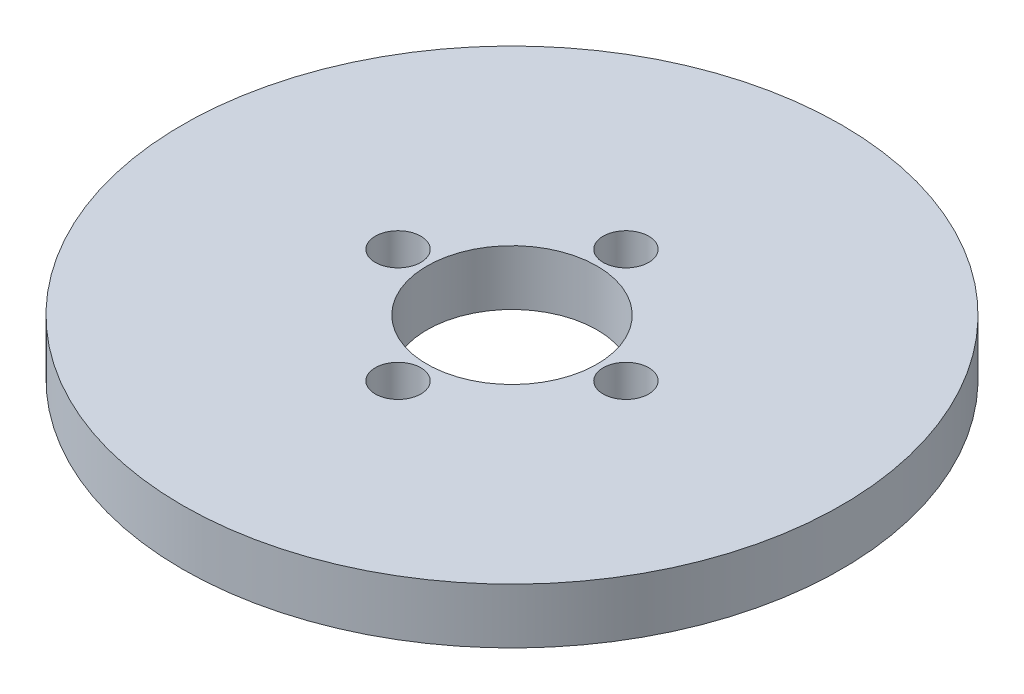
ISO-10303-21;
HEADER;
FILE_DESCRIPTION(('STEP AP214'),'2;1');
FILE_NAME('part.step','',(''),(''),'','','');
FILE_SCHEMA(('AUTOMOTIVE_DESIGN { 1 0 10303 214 1 1 1 1 }'));
ENDSEC;
DATA;
#1=APPLICATION_CONTEXT('core data for automotive mechanical design processes');
#2=APPLICATION_PROTOCOL_DEFINITION('international standard','automotive_design',2000,#1);
#3=PRODUCT_CONTEXT('',#1,'mechanical');
#4=PRODUCT('Part','Part','',(#3));
#5=PRODUCT_RELATED_PRODUCT_CATEGORY('part','',(#4));
#6=PRODUCT_DEFINITION_FORMATION('','',#4);
#7=PRODUCT_DEFINITION_CONTEXT('part definition',#1,'design');
#8=PRODUCT_DEFINITION('design','',#6,#7);
#9=PRODUCT_DEFINITION_SHAPE('','',#8);
#10=(LENGTH_UNIT() NAMED_UNIT(*) SI_UNIT(.MILLI.,.METRE.));
#11=(NAMED_UNIT(*) PLANE_ANGLE_UNIT() SI_UNIT($,.RADIAN.));
#12=(NAMED_UNIT(*) SI_UNIT($,.STERADIAN.) SOLID_ANGLE_UNIT());
#13=UNCERTAINTY_MEASURE_WITH_UNIT(LENGTH_MEASURE(1.E-05),#10,'distance_accuracy_value','');
#14=(GEOMETRIC_REPRESENTATION_CONTEXT(3) GLOBAL_UNCERTAINTY_ASSIGNED_CONTEXT((#13)) GLOBAL_UNIT_ASSIGNED_CONTEXT((#10,
#11,#12)) REPRESENTATION_CONTEXT('',''));
#15=CARTESIAN_POINT('',(0.,0.,0.));
#16=DIRECTION('',(0.,0.,1.));
#17=DIRECTION('',(1.,0.,0.));
#18=AXIS2_PLACEMENT_3D('',#15,#16,#17);
#19=CARTESIAN_POINT('',(0.,13.,0.));
#20=DIRECTION('',(0.,-1.,0.));
#21=DIRECTION('',(0.,0.,-1.));
#22=AXIS2_PLACEMENT_3D('',#19,#20,#21);
#23=CYLINDRICAL_SURFACE('',#22,77.5);
#24=CARTESIAN_POINT('',(0.,13.,0.));
#25=DIRECTION('',(0.,1.,0.));
#26=DIRECTION('',(0.,0.,1.));
#27=AXIS2_PLACEMENT_3D('',#24,#25,#26);
#28=CIRCLE('',#27,77.5);
#29=CARTESIAN_POINT('',(0.,13.,-77.5));
#30=VERTEX_POINT('',#29);
#31=EDGE_CURVE('E10',#30,#30,#28,.T.);
#32=CARTESIAN_POINT('',(0.,0.,0.));
#33=DIRECTION('',(0.,1.,0.));
#34=DIRECTION('',(0.,0.,1.));
#35=AXIS2_PLACEMENT_3D('',#32,#33,#34);
#36=CIRCLE('',#35,77.5);
#37=CARTESIAN_POINT('',(0.,0.,-77.5));
#38=VERTEX_POINT('',#37);
#39=EDGE_CURVE('E37',#38,#38,#36,.T.);
#40=CARTESIAN_POINT('',(0.,13.,-77.5));
#41=CARTESIAN_POINT('',(0.,12.8645833333333,-77.5));
#42=CARTESIAN_POINT('',(0.,12.7291666666667,-77.5));
#43=CARTESIAN_POINT('',(0.,12.4583333333333,-77.5));
#44=CARTESIAN_POINT('',(0.,12.3229166666667,-77.5));
#45=CARTESIAN_POINT('',(0.,12.0520833333333,-77.5));
#46=CARTESIAN_POINT('',(0.,11.9166666666667,-77.5));
#47=CARTESIAN_POINT('',(0.,11.6458333333333,-77.5));
#48=CARTESIAN_POINT('',(0.,11.5104166666667,-77.5));
#49=CARTESIAN_POINT('',(0.,11.2395833333333,-77.5));
#50=CARTESIAN_POINT('',(0.,11.1041666666667,-77.5));
#51=CARTESIAN_POINT('',(0.,10.8333333333333,-77.5));
#52=CARTESIAN_POINT('',(0.,10.6979166666667,-77.5));
#53=CARTESIAN_POINT('',(0.,10.4270833333333,-77.5));
#54=CARTESIAN_POINT('',(0.,10.2916666666667,-77.5));
#55=CARTESIAN_POINT('',(0.,10.0208333333333,-77.5));
#56=CARTESIAN_POINT('',(0.,9.88541666666667,-77.5));
#57=CARTESIAN_POINT('',(0.,9.61458333333333,-77.5));
#58=CARTESIAN_POINT('',(0.,9.47916666666667,-77.5));
#59=CARTESIAN_POINT('',(0.,9.20833333333333,-77.5));
#60=CARTESIAN_POINT('',(0.,9.07291666666666,-77.5));
#61=CARTESIAN_POINT('',(0.,8.80208333333333,-77.5));
#62=CARTESIAN_POINT('',(0.,8.66666666666667,-77.5));
#63=CARTESIAN_POINT('',(0.,8.39583333333333,-77.5));
#64=CARTESIAN_POINT('',(0.,8.26041666666667,-77.5));
#65=CARTESIAN_POINT('',(0.,7.98958333333333,-77.5));
#66=CARTESIAN_POINT('',(0.,7.85416666666667,-77.5));
#67=CARTESIAN_POINT('',(0.,7.58333333333333,-77.5));
#68=CARTESIAN_POINT('',(0.,7.44791666666667,-77.5));
#69=CARTESIAN_POINT('',(0.,7.17708333333333,-77.5));
#70=CARTESIAN_POINT('',(0.,7.04166666666667,-77.5));
#71=CARTESIAN_POINT('',(0.,6.77083333333333,-77.5));
#72=CARTESIAN_POINT('',(0.,6.63541666666667,-77.5));
#73=CARTESIAN_POINT('',(0.,6.36458333333333,-77.5));
#74=CARTESIAN_POINT('',(0.,6.22916666666667,-77.5));
#75=CARTESIAN_POINT('',(0.,5.95833333333333,-77.5));
#76=CARTESIAN_POINT('',(0.,5.82291666666667,-77.5));
#77=CARTESIAN_POINT('',(0.,5.55208333333333,-77.5));
#78=CARTESIAN_POINT('',(0.,5.41666666666667,-77.5));
#79=CARTESIAN_POINT('',(0.,5.14583333333333,-77.5));
#80=CARTESIAN_POINT('',(0.,5.01041666666667,-77.5));
#81=CARTESIAN_POINT('',(0.,4.73958333333333,-77.5));
#82=CARTESIAN_POINT('',(0.,4.60416666666667,-77.5));
#83=CARTESIAN_POINT('',(0.,4.33333333333333,-77.5));
#84=CARTESIAN_POINT('',(0.,4.19791666666667,-77.5));
#85=CARTESIAN_POINT('',(0.,3.92708333333333,-77.5));
#86=CARTESIAN_POINT('',(0.,3.79166666666667,-77.5));
#87=CARTESIAN_POINT('',(0.,3.52083333333333,-77.5));
#88=CARTESIAN_POINT('',(0.,3.38541666666667,-77.5));
#89=CARTESIAN_POINT('',(0.,3.11458333333333,-77.5));
#90=CARTESIAN_POINT('',(0.,2.97916666666667,-77.5));
#91=CARTESIAN_POINT('',(0.,2.70833333333333,-77.5));
#92=CARTESIAN_POINT('',(0.,2.57291666666667,-77.5));
#93=CARTESIAN_POINT('',(0.,2.30208333333333,-77.5));
#94=CARTESIAN_POINT('',(0.,2.16666666666667,-77.5));
#95=CARTESIAN_POINT('',(0.,1.89583333333333,-77.5));
#96=CARTESIAN_POINT('',(0.,1.76041666666667,-77.5));
#97=CARTESIAN_POINT('',(0.,1.48958333333333,-77.5));
#98=CARTESIAN_POINT('',(0.,1.35416666666667,-77.5));
#99=CARTESIAN_POINT('',(0.,1.08333333333333,-77.5));
#100=CARTESIAN_POINT('',(0.,0.947916666666667,-77.5));
#101=CARTESIAN_POINT('',(0.,0.677083333333334,-77.5));
#102=CARTESIAN_POINT('',(0.,0.541666666666667,-77.5));
#103=CARTESIAN_POINT('',(0.,0.270833333333334,-77.5));
#104=CARTESIAN_POINT('',(0.,0.135416666666667,-77.5));
#105=CARTESIAN_POINT('',(0.,0.,-77.5));
#106=B_SPLINE_CURVE_WITH_KNOTS('',3,(#40,#41,#42,#43,#44,#45,#46,#47,#48,#49,#50,#51,#52,#53,
#54,#55,#56,#57,#58,#59,#60,#61,#62,#63,#64,#65,#66,#67,#68,#69,#70,#71,#72,#73,#74,#75,#76,#77,
#78,#79,#80,#81,#82,#83,#84,#85,#86,#87,#88,#89,#90,#91,#92,#93,#94,#95,#96,#97,#98,#99,#100,
#101,#102,#103,#104,#105),.UNSPECIFIED.,.F.,.F.,(4,2,2,2,2,2,2,2,2,2,2,2,2,2,2,2,2,2,2,2,2,2,2,
2,2,2,2,2,2,2,2,2,4),(0.,0.40625,0.812500000000001,1.21875,1.625,2.03125,2.4375,2.84375,3.25,
3.65625,4.0625,4.46875,4.875,5.28125,5.6875,6.09375,6.5,6.90625,7.3125,7.71875,8.125,8.53125,
8.9375,9.34375,9.75,10.15625,10.5625,10.96875,11.375,11.78125,12.1875,12.59375,13.),.UNSPECIFIED.);
#107=EDGE_CURVE('BSEAM40',#30,#38,#106,.T.);
#108=ORIENTED_EDGE('',*,*,#31,.F.);
#109=ORIENTED_EDGE('',*,*,#39,.T.);
#110=ORIENTED_EDGE('',*,*,#107,.T.);
#111=ORIENTED_EDGE('',*,*,#107,.F.);
#112=EDGE_LOOP('',(#108,#110,#109,#111));
#113=FACE_BOUND('',#112,.T.);
#114=ADVANCED_FACE('F40',(#113),#23,.T.);
#115=CARTESIAN_POINT('',(0.,13.,0.));
#116=DIRECTION('',(0.,1.,0.));
#117=DIRECTION('',(0.,0.,1.));
#118=AXIS2_PLACEMENT_3D('',#115,#116,#117);
#119=PLANE('',#118);
#120=CARTESIAN_POINT('',(0.,13.,26.7972048653097));
#121=DIRECTION('',(0.,1.,0.));
#122=DIRECTION('',(1.,0.,0.));
#123=AXIS2_PLACEMENT_3D('',#120,#121,#122);
#124=CIRCLE('',#123,5.35752603906357);
#125=CARTESIAN_POINT('',(5.35752603906366,13.,26.7972048653097));
#126=VERTEX_POINT('',#125);
#127=EDGE_CURVE('E71',#126,#126,#124,.T.);
#128=ORIENTED_EDGE('',*,*,#127,.F.);
#129=EDGE_LOOP('',(#128));
#130=FACE_BOUND('',#129,.T.);
#131=CARTESIAN_POINT('',(26.7972048653097,13.,0.));
#132=DIRECTION('',(0.,1.,0.));
#133=DIRECTION('',(0.,0.,-1.));
#134=AXIS2_PLACEMENT_3D('',#131,#132,#133);
#135=CIRCLE('',#134,5.35752603906357);
#136=CARTESIAN_POINT('',(26.7972048653097,13.,-5.35752603906357));
#137=VERTEX_POINT('',#136);
#138=EDGE_CURVE('E70',#137,#137,#135,.T.);
#139=ORIENTED_EDGE('',*,*,#138,.F.);
#140=EDGE_LOOP('',(#139));
#141=FACE_BOUND('',#140,.T.);
#142=CARTESIAN_POINT('',(-2.80685822161156E-13,13.,-26.7972048653097));
#143=DIRECTION('',(0.,1.,0.));
#144=DIRECTION('',(-1.,0.,0.));
#145=AXIS2_PLACEMENT_3D('',#142,#143,#144);
#146=CIRCLE('',#145,5.35752603906357);
#147=CARTESIAN_POINT('',(-5.35752603906385,13.,-26.7972048653096));
#148=VERTEX_POINT('',#147);
#149=EDGE_CURVE('E61',#148,#148,#146,.T.);
#150=ORIENTED_EDGE('',*,*,#149,.F.);
#151=EDGE_LOOP('',(#150));
#152=FACE_BOUND('',#151,.T.);
#153=CARTESIAN_POINT('',(-26.7972048653097,13.,0.));
#154=DIRECTION('',(0.,1.,0.));
#155=DIRECTION('',(0.,0.,1.));
#156=AXIS2_PLACEMENT_3D('',#153,#154,#155);
#157=CIRCLE('',#156,5.35752603906357);
#158=CARTESIAN_POINT('',(-26.7972048653097,13.,5.35752603906357));
#159=VERTEX_POINT('',#158);
#160=EDGE_CURVE('E54',#159,#159,#157,.T.);
#161=ORIENTED_EDGE('',*,*,#160,.F.);
#162=EDGE_LOOP('',(#161));
#163=FACE_BOUND('',#162,.T.);
#164=CARTESIAN_POINT('',(0.,13.,0.));
#165=DIRECTION('',(0.,1.,0.));
#166=DIRECTION('',(0.,0.,1.));
#167=AXIS2_PLACEMENT_3D('',#164,#165,#166);
#168=CIRCLE('',#167,20.);
#169=CARTESIAN_POINT('',(0.,13.,-20.));
#170=VERTEX_POINT('',#169);
#171=EDGE_CURVE('E50',#170,#170,#168,.T.);
#172=ORIENTED_EDGE('',*,*,#171,.F.);
#173=EDGE_LOOP('',(#172));
#174=FACE_BOUND('',#173,.T.);
#175=ORIENTED_EDGE('',*,*,#31,.T.);
#176=EDGE_LOOP('',(#175));
#177=FACE_BOUND('',#176,.T.);
#178=ADVANCED_FACE('F86',(#130,#141,#152,#163,#174,#177),#119,.T.);
#179=CARTESIAN_POINT('',(0.,0.,0.));
#180=DIRECTION('',(0.,1.,0.));
#181=DIRECTION('',(0.,0.,1.));
#182=AXIS2_PLACEMENT_3D('',#179,#180,#181);
#183=PLANE('',#182);
#184=CARTESIAN_POINT('',(0.,0.,0.));
#185=DIRECTION('',(0.,1.,0.));
#186=DIRECTION('',(0.,0.,1.));
#187=AXIS2_PLACEMENT_3D('',#184,#185,#186);
#188=CIRCLE('',#187,20.);
#189=CARTESIAN_POINT('',(0.,0.,-20.));
#190=VERTEX_POINT('',#189);
#191=EDGE_CURVE('E47',#190,#190,#188,.T.);
#192=ORIENTED_EDGE('',*,*,#191,.T.);
#193=EDGE_LOOP('',(#192));
#194=FACE_BOUND('',#193,.T.);
#195=ORIENTED_EDGE('',*,*,#39,.F.);
#196=EDGE_LOOP('',(#195));
#197=FACE_BOUND('',#196,.T.);
#198=ADVANCED_FACE('F93',(#194,#197),#183,.F.);
#199=CARTESIAN_POINT('',(0.,13.,0.));
#200=DIRECTION('',(0.,-1.,0.));
#201=DIRECTION('',(0.,0.,-1.));
#202=AXIS2_PLACEMENT_3D('',#199,#200,#201);
#203=CYLINDRICAL_SURFACE('',#202,20.);
#204=CARTESIAN_POINT('',(0.,13.,-20.));
#205=CARTESIAN_POINT('',(0.,12.8645833333333,-20.));
#206=CARTESIAN_POINT('',(0.,12.7291666666667,-20.));
#207=CARTESIAN_POINT('',(0.,12.4583333333333,-20.));
#208=CARTESIAN_POINT('',(0.,12.3229166666667,-20.));
#209=CARTESIAN_POINT('',(0.,12.0520833333333,-20.));
#210=CARTESIAN_POINT('',(0.,11.9166666666667,-20.));
#211=CARTESIAN_POINT('',(0.,11.6458333333333,-20.));
#212=CARTESIAN_POINT('',(0.,11.5104166666667,-20.));
#213=CARTESIAN_POINT('',(0.,11.2395833333333,-20.));
#214=CARTESIAN_POINT('',(0.,11.1041666666667,-20.));
#215=CARTESIAN_POINT('',(0.,10.8333333333333,-20.));
#216=CARTESIAN_POINT('',(0.,10.6979166666667,-20.));
#217=CARTESIAN_POINT('',(0.,10.4270833333333,-20.));
#218=CARTESIAN_POINT('',(0.,10.2916666666667,-20.));
#219=CARTESIAN_POINT('',(0.,10.0208333333333,-20.));
#220=CARTESIAN_POINT('',(0.,9.88541666666667,-20.));
#221=CARTESIAN_POINT('',(0.,9.61458333333333,-20.));
#222=CARTESIAN_POINT('',(0.,9.47916666666667,-20.));
#223=CARTESIAN_POINT('',(0.,9.20833333333333,-20.));
#224=CARTESIAN_POINT('',(0.,9.07291666666666,-20.));
#225=CARTESIAN_POINT('',(0.,8.80208333333333,-20.));
#226=CARTESIAN_POINT('',(0.,8.66666666666667,-20.));
#227=CARTESIAN_POINT('',(0.,8.39583333333333,-20.));
#228=CARTESIAN_POINT('',(0.,8.26041666666667,-20.));
#229=CARTESIAN_POINT('',(0.,7.98958333333333,-20.));
#230=CARTESIAN_POINT('',(0.,7.85416666666667,-20.));
#231=CARTESIAN_POINT('',(0.,7.58333333333333,-20.));
#232=CARTESIAN_POINT('',(0.,7.44791666666667,-20.));
#233=CARTESIAN_POINT('',(0.,7.17708333333333,-20.));
#234=CARTESIAN_POINT('',(0.,7.04166666666667,-20.));
#235=CARTESIAN_POINT('',(0.,6.77083333333333,-20.));
#236=CARTESIAN_POINT('',(0.,6.63541666666667,-20.));
#237=CARTESIAN_POINT('',(0.,6.36458333333333,-20.));
#238=CARTESIAN_POINT('',(0.,6.22916666666667,-20.));
#239=CARTESIAN_POINT('',(0.,5.95833333333333,-20.));
#240=CARTESIAN_POINT('',(0.,5.82291666666667,-20.));
#241=CARTESIAN_POINT('',(0.,5.55208333333333,-20.));
#242=CARTESIAN_POINT('',(0.,5.41666666666667,-20.));
#243=CARTESIAN_POINT('',(0.,5.14583333333333,-20.));
#244=CARTESIAN_POINT('',(0.,5.01041666666667,-20.));
#245=CARTESIAN_POINT('',(0.,4.73958333333333,-20.));
#246=CARTESIAN_POINT('',(0.,4.60416666666667,-20.));
#247=CARTESIAN_POINT('',(0.,4.33333333333333,-20.));
#248=CARTESIAN_POINT('',(0.,4.19791666666667,-20.));
#249=CARTESIAN_POINT('',(0.,3.92708333333333,-20.));
#250=CARTESIAN_POINT('',(0.,3.79166666666667,-20.));
#251=CARTESIAN_POINT('',(0.,3.52083333333333,-20.));
#252=CARTESIAN_POINT('',(0.,3.38541666666667,-20.));
#253=CARTESIAN_POINT('',(0.,3.11458333333333,-20.));
#254=CARTESIAN_POINT('',(0.,2.97916666666667,-20.));
#255=CARTESIAN_POINT('',(0.,2.70833333333333,-20.));
#256=CARTESIAN_POINT('',(0.,2.57291666666667,-20.));
#257=CARTESIAN_POINT('',(0.,2.30208333333333,-20.));
#258=CARTESIAN_POINT('',(0.,2.16666666666667,-20.));
#259=CARTESIAN_POINT('',(0.,1.89583333333333,-20.));
#260=CARTESIAN_POINT('',(0.,1.76041666666667,-20.));
#261=CARTESIAN_POINT('',(0.,1.48958333333333,-20.));
#262=CARTESIAN_POINT('',(0.,1.35416666666667,-20.));
#263=CARTESIAN_POINT('',(0.,1.08333333333333,-20.));
#264=CARTESIAN_POINT('',(0.,0.947916666666667,-20.));
#265=CARTESIAN_POINT('',(0.,0.677083333333334,-20.));
#266=CARTESIAN_POINT('',(0.,0.541666666666667,-20.));
#267=CARTESIAN_POINT('',(0.,0.270833333333334,-20.));
#268=CARTESIAN_POINT('',(0.,0.135416666666667,-20.));
#269=CARTESIAN_POINT('',(0.,0.,-20.));
#270=B_SPLINE_CURVE_WITH_KNOTS('',3,(#204,#205,#206,#207,#208,#209,#210,#211,#212,#213,#214,
#215,#216,#217,#218,#219,#220,#221,#222,#223,#224,#225,#226,#227,#228,#229,#230,#231,#232,#233,
#234,#235,#236,#237,#238,#239,#240,#241,#242,#243,#244,#245,#246,#247,#248,#249,#250,#251,#252,
#253,#254,#255,#256,#257,#258,#259,#260,#261,#262,#263,#264,#265,#266,#267,#268,#269),
.UNSPECIFIED.,.F.,.F.,(4,2,2,2,2,2,2,2,2,2,2,2,2,2,2,2,2,2,2,2,2,2,2,2,2,2,2,2,2,2,2,2,4),(0.,
0.40625,0.812500000000001,1.21875,1.625,2.03125,2.4375,2.84375,3.25,3.65625,4.0625,4.46875,
4.875,5.28125,5.6875,6.09375,6.5,6.90625,7.3125,7.71875,8.125,8.53125,8.9375,9.34375,9.75,
10.15625,10.5625,10.96875,11.375,11.78125,12.1875,12.59375,13.),.UNSPECIFIED.);
#271=EDGE_CURVE('BSEAM101',#170,#190,#270,.T.);
#272=ORIENTED_EDGE('',*,*,#171,.T.);
#273=ORIENTED_EDGE('',*,*,#191,.F.);
#274=ORIENTED_EDGE('',*,*,#271,.T.);
#275=ORIENTED_EDGE('',*,*,#271,.F.);
#276=EDGE_LOOP('',(#272,#274,#273,#275));
#277=FACE_BOUND('',#276,.T.);
#278=ADVANCED_FACE('F101',(#277),#203,.F.);
#279=CARTESIAN_POINT('',(-26.7972048653097,4.02987590164074,0.));
#280=DIRECTION('',(0.,1.,0.));
#281=DIRECTION('',(0.,0.,1.));
#282=AXIS2_PLACEMENT_3D('',#279,#280,#281);
#283=CYLINDRICAL_SURFACE('',#282,5.35752603906357);
#284=CARTESIAN_POINT('',(-26.7972048653097,4.02987590164074,0.));
#285=DIRECTION('',(0.,1.,0.));
#286=DIRECTION('',(0.,0.,1.));
#287=AXIS2_PLACEMENT_3D('',#284,#285,#286);
#288=CIRCLE('',#287,5.35752603906357);
#289=CARTESIAN_POINT('',(-26.7972048653097,4.02987590164074,5.35752603906357));
#290=VERTEX_POINT('',#289);
#291=EDGE_CURVE('E55',#290,#290,#288,.T.);
#292=ORIENTED_EDGE('',*,*,#291,.F.);
#293=EDGE_LOOP('',(#292));
#294=FACE_BOUND('',#293,.T.);
#295=ORIENTED_EDGE('',*,*,#160,.T.);
#296=EDGE_LOOP('',(#295));
#297=FACE_BOUND('',#296,.T.);
#298=ADVANCED_FACE('F102',(#294,#297),#283,.F.);
#299=CARTESIAN_POINT('',(-26.7972048653097,4.02987590164074,0.));
#300=DIRECTION('',(0.,1.,0.));
#301=DIRECTION('',(0.,0.,1.));
#302=AXIS2_PLACEMENT_3D('',#299,#300,#301);
#303=PLANE('',#302);
#304=ORIENTED_EDGE('',*,*,#291,.T.);
#305=EDGE_LOOP('',(#304));
#306=FACE_BOUND('',#305,.T.);
#307=ADVANCED_FACE('F133',(#306),#303,.T.);
#308=CARTESIAN_POINT('',(-2.80685822161156E-13,4.02987590164074,-26.7972048653097));
#309=DIRECTION('',(0.,1.,0.));
#310=DIRECTION('',(0.,0.,1.));
#311=AXIS2_PLACEMENT_3D('',#308,#309,#310);
#312=CYLINDRICAL_SURFACE('',#311,5.35752603906357);
#313=CARTESIAN_POINT('',(-2.80685822161156E-13,4.02987590164074,-26.7972048653097));
#314=DIRECTION('',(0.,1.,0.));
#315=DIRECTION('',(-1.,0.,0.));
#316=AXIS2_PLACEMENT_3D('',#313,#314,#315);
#317=CIRCLE('',#316,5.35752603906357);
#318=CARTESIAN_POINT('',(-5.35752603906385,4.02987590164074,-26.7972048653096));
#319=VERTEX_POINT('',#318);
#320=EDGE_CURVE('E63',#319,#319,#317,.T.);
#321=ORIENTED_EDGE('',*,*,#320,.F.);
#322=EDGE_LOOP('',(#321));
#323=FACE_BOUND('',#322,.T.);
#324=ORIENTED_EDGE('',*,*,#149,.T.);
#325=EDGE_LOOP('',(#324));
#326=FACE_BOUND('',#325,.T.);
#327=ADVANCED_FACE('F142',(#323,#326),#312,.F.);
#328=CARTESIAN_POINT('',(-2.80685822161156E-13,4.02987590164074,-26.7972048653097));
#329=DIRECTION('',(0.,1.,0.));
#330=DIRECTION('',(-1.,0.,0.));
#331=AXIS2_PLACEMENT_3D('',#328,#329,#330);
#332=PLANE('',#331);
#333=ORIENTED_EDGE('',*,*,#320,.T.);
#334=EDGE_LOOP('',(#333));
#335=FACE_BOUND('',#334,.T.);
#336=ADVANCED_FACE('F156',(#335),#332,.T.);
#337=CARTESIAN_POINT('',(26.7972048653097,4.02987590164074,0.));
#338=DIRECTION('',(0.,1.,0.));
#339=DIRECTION('',(0.,0.,1.));
#340=AXIS2_PLACEMENT_3D('',#337,#338,#339);
#341=CYLINDRICAL_SURFACE('',#340,5.35752603906357);
#342=CARTESIAN_POINT('',(26.7972048653097,4.02987590164074,0.));
#343=DIRECTION('',(0.,1.,0.));
#344=DIRECTION('',(0.,0.,-1.));
#345=AXIS2_PLACEMENT_3D('',#342,#343,#344);
#346=CIRCLE('',#345,5.35752603906357);
#347=CARTESIAN_POINT('',(26.7972048653097,4.02987590164074,-5.35752603906357));
#348=VERTEX_POINT('',#347);
#349=EDGE_CURVE('E69',#348,#348,#346,.T.);
#350=ORIENTED_EDGE('',*,*,#349,.F.);
#351=EDGE_LOOP('',(#350));
#352=FACE_BOUND('',#351,.T.);
#353=ORIENTED_EDGE('',*,*,#138,.T.);
#354=EDGE_LOOP('',(#353));
#355=FACE_BOUND('',#354,.T.);
#356=ADVANCED_FACE('F164',(#352,#355),#341,.F.);
#357=CARTESIAN_POINT('',(26.7972048653097,4.02987590164074,0.));
#358=DIRECTION('',(0.,1.,0.));
#359=DIRECTION('',(0.,0.,-1.));
#360=AXIS2_PLACEMENT_3D('',#357,#358,#359);
#361=PLANE('',#360);
#362=ORIENTED_EDGE('',*,*,#349,.T.);
#363=EDGE_LOOP('',(#362));
#364=FACE_BOUND('',#363,.T.);
#365=ADVANCED_FACE('F83',(#364),#361,.T.);
#366=CARTESIAN_POINT('',(0.,4.02987590164074,26.7972048653097));
#367=DIRECTION('',(0.,1.,0.));
#368=DIRECTION('',(0.,0.,1.));
#369=AXIS2_PLACEMENT_3D('',#366,#367,#368);
#370=CYLINDRICAL_SURFACE('',#369,5.35752603906357);
#371=CARTESIAN_POINT('',(0.,4.02987590164074,26.7972048653097));
#372=DIRECTION('',(0.,1.,0.));
#373=DIRECTION('',(1.,0.,0.));
#374=AXIS2_PLACEMENT_3D('',#371,#372,#373);
#375=CIRCLE('',#374,5.35752603906357);
#376=CARTESIAN_POINT('',(5.35752603906366,4.02987590164074,26.7972048653097));
#377=VERTEX_POINT('',#376);
#378=EDGE_CURVE('E59',#377,#377,#375,.T.);
#379=ORIENTED_EDGE('',*,*,#378,.F.);
#380=EDGE_LOOP('',(#379));
#381=FACE_BOUND('',#380,.T.);
#382=ORIENTED_EDGE('',*,*,#127,.T.);
#383=EDGE_LOOP('',(#382));
#384=FACE_BOUND('',#383,.T.);
#385=ADVANCED_FACE('F81',(#381,#384),#370,.F.);
#386=CARTESIAN_POINT('',(0.,4.02987590164074,26.7972048653097));
#387=DIRECTION('',(0.,1.,0.));
#388=DIRECTION('',(1.,0.,0.));
#389=AXIS2_PLACEMENT_3D('',#386,#387,#388);
#390=PLANE('',#389);
#391=ORIENTED_EDGE('',*,*,#378,.T.);
#392=EDGE_LOOP('',(#391));
#393=FACE_BOUND('',#392,.T.);
#394=ADVANCED_FACE('F78',(#393),#390,.T.);
#395=CLOSED_SHELL('',(#114,#178,#198,#278,#298,#307,#327,#336,#356,#365,#385,#394));
#396=MANIFOLD_SOLID_BREP('B2',#395);
#397=ADVANCED_BREP_SHAPE_REPRESENTATION('',(#18,#396),#14);
#398=SHAPE_DEFINITION_REPRESENTATION(#9,#397);
ENDSEC;
END-ISO-10303-21;
